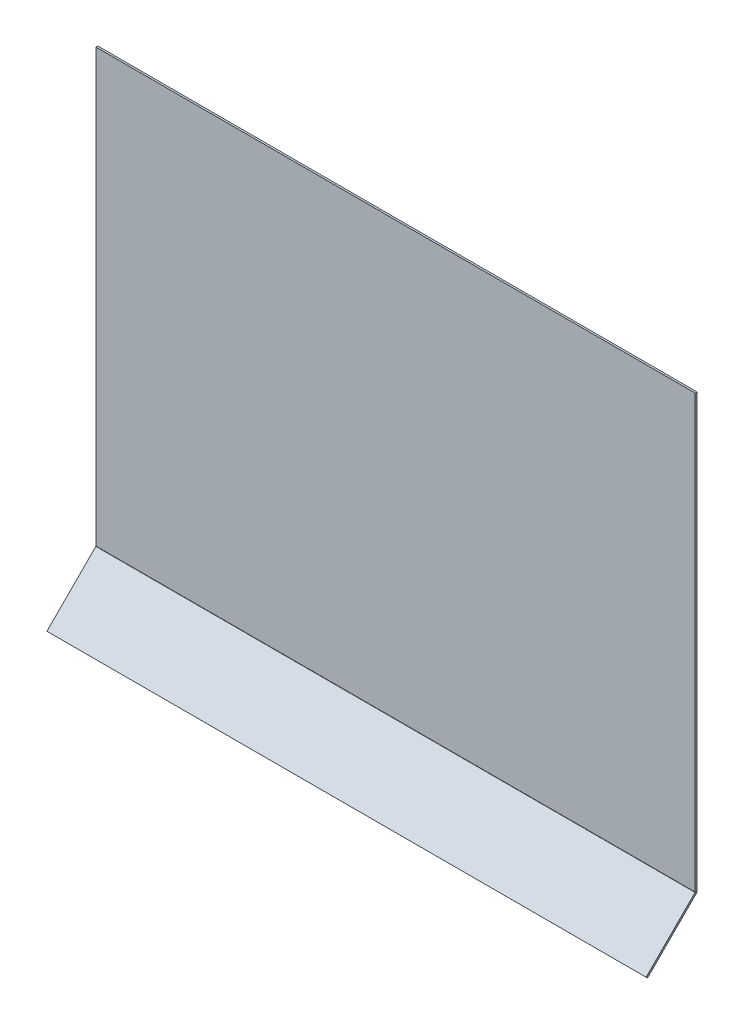
ISO-10303-21;
HEADER;
FILE_DESCRIPTION(('STEP AP214'),'2;1');
FILE_NAME('part.step','',(''),(''),'','','');
FILE_SCHEMA(('AUTOMOTIVE_DESIGN { 1 0 10303 214 1 1 1 1 }'));
ENDSEC;
DATA;
#1=APPLICATION_CONTEXT('core data for automotive mechanical design processes');
#2=APPLICATION_PROTOCOL_DEFINITION('international standard','automotive_design',2000,#1);
#3=PRODUCT_CONTEXT('',#1,'mechanical');
#4=PRODUCT('Part','Part','',(#3));
#5=PRODUCT_RELATED_PRODUCT_CATEGORY('part','',(#4));
#6=PRODUCT_DEFINITION_FORMATION('','',#4);
#7=PRODUCT_DEFINITION_CONTEXT('part definition',#1,'design');
#8=PRODUCT_DEFINITION('design','',#6,#7);
#9=PRODUCT_DEFINITION_SHAPE('','',#8);
#10=(LENGTH_UNIT() NAMED_UNIT(*) SI_UNIT(.MILLI.,.METRE.));
#11=(NAMED_UNIT(*) PLANE_ANGLE_UNIT() SI_UNIT($,.RADIAN.));
#12=(NAMED_UNIT(*) SI_UNIT($,.STERADIAN.) SOLID_ANGLE_UNIT());
#13=UNCERTAINTY_MEASURE_WITH_UNIT(LENGTH_MEASURE(1.E-05),#10,'distance_accuracy_value','');
#14=(GEOMETRIC_REPRESENTATION_CONTEXT(3) GLOBAL_UNCERTAINTY_ASSIGNED_CONTEXT((#13)) GLOBAL_UNIT_ASSIGNED_CONTEXT((#10,
#11,#12)) REPRESENTATION_CONTEXT('',''));
#15=CARTESIAN_POINT('',(0.,0.,0.));
#16=DIRECTION('',(0.,0.,1.));
#17=DIRECTION('',(1.,0.,0.));
#18=AXIS2_PLACEMENT_3D('',#15,#16,#17);
#19=CARTESIAN_POINT('',(-475.,-363.086855640565,-687.218254069481));
#20=DIRECTION('',(0.,-0.707106781186552,0.707106781186544));
#21=DIRECTION('',(1.,0.,0.));
#22=AXIS2_PLACEMENT_3D('',#19,#20,#21);
#23=PLANE('',#22);
#24=DIRECTION('',(0.,0.707106781186544,0.707106781186552));
#25=VECTOR('',#24,1.);
#26=CARTESIAN_POINT('',(-475.,-363.086855640565,-687.218254069481));
#27=LINE('',#26,#25);
#28=CARTESIAN_POINT('',(-475.,-365.208175984124,-689.339574413041));
#29=VERTEX_POINT('',#28);
#30=CARTESIAN_POINT('',(-475.,-363.086855640565,-687.218254069481));
#31=VERTEX_POINT('',#30);
#32=EDGE_CURVE('E11',#29,#31,#27,.T.);
#33=ORIENTED_EDGE('',*,*,#32,.F.);
#34=DIRECTION('',(1.,0.,0.));
#35=VECTOR('',#34,1.);
#36=CARTESIAN_POINT('',(0.,-365.208175984124,-689.339574413041));
#37=LINE('',#36,#35);
#38=CARTESIAN_POINT('',(475.,-365.208175984124,-689.339574413041));
#39=VERTEX_POINT('',#38);
#40=EDGE_CURVE('E119',#39,#29,#37,.F.);
#41=ORIENTED_EDGE('',*,*,#40,.F.);
#42=DIRECTION('',(0.,0.707106781186544,0.707106781186552));
#43=VECTOR('',#42,1.);
#44=CARTESIAN_POINT('',(475.,-363.086855640565,-687.218254069481));
#45=LINE('',#44,#43);
#46=CARTESIAN_POINT('',(475.,-363.086855640565,-687.218254069481));
#47=VERTEX_POINT('',#46);
#48=EDGE_CURVE('E51',#39,#47,#45,.T.);
#49=ORIENTED_EDGE('',*,*,#48,.T.);
#50=DIRECTION('',(1.,0.,0.));
#51=VECTOR('',#50,1.);
#52=CARTESIAN_POINT('',(-475.,-363.086855640565,-687.218254069481));
#53=LINE('',#52,#51);
#54=EDGE_CURVE('E177',#47,#31,#53,.F.);
#55=ORIENTED_EDGE('',*,*,#54,.T.);
#56=EDGE_LOOP('',(#33,#41,#49,#55));
#57=FACE_BOUND('',#56,.T.);
#58=ADVANCED_FACE('F41',(#57),#23,.T.);
#59=CARTESIAN_POINT('',(475.,-363.086855640565,-687.218254069481));
#60=DIRECTION('',(1.,0.,0.));
#61=DIRECTION('',(0.,0.707106781186552,-0.707106781186544));
#62=AXIS2_PLACEMENT_3D('',#59,#60,#61);
#63=PLANE('',#62);
#64=ORIENTED_EDGE('',*,*,#48,.F.);
#65=DIRECTION('',(0.,-0.707106781186552,0.707106781186544));
#66=VECTOR('',#65,1.);
#67=CARTESIAN_POINT('',(475.,-527.426430053602,-527.121320343564));
#68=LINE('',#67,#66);
#69=CARTESIAN_POINT('',(475.,-287.642175198581,-766.905575198582));
#70=VERTEX_POINT('',#69);
#71=EDGE_CURVE('E116',#70,#39,#68,.T.);
#72=ORIENTED_EDGE('',*,*,#71,.F.);
#73=DIRECTION('',(0.,0.707106781186547,0.707106781186547));
#74=VECTOR('',#73,1.);
#75=CARTESIAN_POINT('',(475.,-285.520854855022,-764.784254855023));
#76=LINE('',#75,#74);
#77=CARTESIAN_POINT('',(475.,-285.520854855022,-764.784254855023));
#78=VERTEX_POINT('',#77);
#79=EDGE_CURVE('E160',#70,#78,#76,.T.);
#80=ORIENTED_EDGE('',*,*,#79,.T.);
#81=DIRECTION('',(0.,0.707106781186552,-0.707106781186544));
#82=VECTOR('',#81,1.);
#83=CARTESIAN_POINT('',(475.,-363.086855640565,-687.218254069481));
#84=LINE('',#83,#82);
#85=EDGE_CURVE('E168',#78,#47,#84,.F.);
#86=ORIENTED_EDGE('',*,*,#85,.T.);
#87=EDGE_LOOP('',(#64,#72,#80,#86));
#88=FACE_BOUND('',#87,.T.);
#89=ADVANCED_FACE('F167',(#88),#63,.T.);
#90=CARTESIAN_POINT('',(475.,-285.,-764.263400000001));
#91=DIRECTION('',(-1.,0.,0.));
#92=DIRECTION('',(0.,0.,1.));
#93=AXIS2_PLACEMENT_3D('',#90,#91,#92);
#94=PLANE('',#93);
#95=ORIENTED_EDGE('',*,*,#79,.F.);
#96=CARTESIAN_POINT('',(475.,-285.,-764.263400000001));
#97=DIRECTION('',(1.,0.,0.));
#98=DIRECTION('',(0.,0.,-1.));
#99=AXIS2_PLACEMENT_3D('',#96,#97,#98);
#100=CIRCLE('',#99,3.73660000000008);
#101=CARTESIAN_POINT('',(475.,-285.,-768.));
#102=VERTEX_POINT('',#101);
#103=EDGE_CURVE('E111',#70,#102,#100,.T.);
#104=ORIENTED_EDGE('',*,*,#103,.T.);
#105=DIRECTION('',(0.,0.,1.));
#106=VECTOR('',#105,1.);
#107=CARTESIAN_POINT('',(475.,-285.,-765.));
#108=LINE('',#107,#106);
#109=CARTESIAN_POINT('',(475.,-285.,-765.));
#110=VERTEX_POINT('',#109);
#111=EDGE_CURVE('E157',#102,#110,#108,.T.);
#112=ORIENTED_EDGE('',*,*,#111,.T.);
#113=CARTESIAN_POINT('',(475.,-285.,-764.263400000001));
#114=DIRECTION('',(1.,0.,0.));
#115=DIRECTION('',(0.,0.,-1.));
#116=AXIS2_PLACEMENT_3D('',#113,#114,#115);
#117=CIRCLE('',#116,0.736600000000081);
#118=EDGE_CURVE('E100',#78,#110,#117,.T.);
#119=ORIENTED_EDGE('',*,*,#118,.F.);
#120=EDGE_LOOP('',(#95,#104,#112,#119));
#121=FACE_BOUND('',#120,.T.);
#122=ADVANCED_FACE('F182',(#121),#94,.F.);
#123=CARTESIAN_POINT('',(475.,400.,-765.));
#124=DIRECTION('',(1.,0.,0.));
#125=DIRECTION('',(0.,-1.,0.));
#126=AXIS2_PLACEMENT_3D('',#123,#124,#125);
#127=PLANE('',#126);
#128=ORIENTED_EDGE('',*,*,#111,.F.);
#129=DIRECTION('',(0.,1.,0.));
#130=VECTOR('',#129,1.);
#131=CARTESIAN_POINT('',(475.,2.11801214624424E-13,-768.));
#132=LINE('',#131,#130);
#133=CARTESIAN_POINT('',(475.,400.,-768.));
#134=VERTEX_POINT('',#133);
#135=EDGE_CURVE('E144',#134,#102,#132,.F.);
#136=ORIENTED_EDGE('',*,*,#135,.F.);
#137=DIRECTION('',(0.,0.,1.));
#138=VECTOR('',#137,1.);
#139=CARTESIAN_POINT('',(475.,400.,-765.));
#140=LINE('',#139,#138);
#141=CARTESIAN_POINT('',(475.,400.,-765.));
#142=VERTEX_POINT('',#141);
#143=EDGE_CURVE('E154',#134,#142,#140,.T.);
#144=ORIENTED_EDGE('',*,*,#143,.T.);
#145=DIRECTION('',(0.,-1.,0.));
#146=VECTOR('',#145,1.);
#147=CARTESIAN_POINT('',(475.,400.,-765.));
#148=LINE('',#147,#146);
#149=EDGE_CURVE('E212',#142,#110,#148,.T.);
#150=ORIENTED_EDGE('',*,*,#149,.T.);
#151=EDGE_LOOP('',(#128,#136,#144,#150));
#152=FACE_BOUND('',#151,.T.);
#153=ADVANCED_FACE('F209',(#152),#127,.T.);
#154=CARTESIAN_POINT('',(475.,400.,-765.));
#155=DIRECTION('',(0.,1.,0.));
#156=DIRECTION('',(1.,0.,0.));
#157=AXIS2_PLACEMENT_3D('',#154,#155,#156);
#158=PLANE('',#157);
#159=ORIENTED_EDGE('',*,*,#143,.F.);
#160=DIRECTION('',(1.,0.,0.));
#161=VECTOR('',#160,1.);
#162=CARTESIAN_POINT('',(0.,400.,-768.));
#163=LINE('',#162,#161);
#164=CARTESIAN_POINT('',(-475.,400.,-768.));
#165=VERTEX_POINT('',#164);
#166=EDGE_CURVE('E140',#165,#134,#163,.T.);
#167=ORIENTED_EDGE('',*,*,#166,.F.);
#168=DIRECTION('',(0.,0.,1.));
#169=VECTOR('',#168,1.);
#170=CARTESIAN_POINT('',(-475.,400.,-765.));
#171=LINE('',#170,#169);
#172=CARTESIAN_POINT('',(-475.,400.,-765.));
#173=VERTEX_POINT('',#172);
#174=EDGE_CURVE('E151',#165,#173,#171,.T.);
#175=ORIENTED_EDGE('',*,*,#174,.T.);
#176=DIRECTION('',(1.,0.,0.));
#177=VECTOR('',#176,1.);
#178=CARTESIAN_POINT('',(475.,400.,-765.));
#179=LINE('',#178,#177);
#180=EDGE_CURVE('E179',#173,#142,#179,.T.);
#181=ORIENTED_EDGE('',*,*,#180,.T.);
#182=EDGE_LOOP('',(#159,#167,#175,#181));
#183=FACE_BOUND('',#182,.T.);
#184=ADVANCED_FACE('F236',(#183),#158,.T.);
#185=CARTESIAN_POINT('',(-475.,400.,-765.));
#186=DIRECTION('',(-1.,0.,0.));
#187=DIRECTION('',(0.,1.,0.));
#188=AXIS2_PLACEMENT_3D('',#185,#186,#187);
#189=PLANE('',#188);
#190=ORIENTED_EDGE('',*,*,#174,.F.);
#191=DIRECTION('',(0.,1.,0.));
#192=VECTOR('',#191,1.);
#193=CARTESIAN_POINT('',(-475.,2.11801214624424E-13,-768.));
#194=LINE('',#193,#192);
#195=CARTESIAN_POINT('',(-475.,-285.,-768.));
#196=VERTEX_POINT('',#195);
#197=EDGE_CURVE('E135',#196,#165,#194,.T.);
#198=ORIENTED_EDGE('',*,*,#197,.F.);
#199=DIRECTION('',(3.01445295852664E-13,0.,1.));
#200=VECTOR('',#199,1.);
#201=CARTESIAN_POINT('',(-475.,-285.,-765.));
#202=LINE('',#201,#200);
#203=CARTESIAN_POINT('',(-475.,-285.,-765.));
#204=VERTEX_POINT('',#203);
#205=EDGE_CURVE('E99',#196,#204,#202,.T.);
#206=ORIENTED_EDGE('',*,*,#205,.T.);
#207=DIRECTION('',(0.,1.,0.));
#208=VECTOR('',#207,1.);
#209=CARTESIAN_POINT('',(-475.,400.,-765.));
#210=LINE('',#209,#208);
#211=EDGE_CURVE('E130',#204,#173,#210,.T.);
#212=ORIENTED_EDGE('',*,*,#211,.T.);
#213=EDGE_LOOP('',(#190,#198,#206,#212));
#214=FACE_BOUND('',#213,.T.);
#215=ADVANCED_FACE('F230',(#214),#189,.T.);
#216=CARTESIAN_POINT('',(-475.,-285.,-764.263400000001));
#217=DIRECTION('',(-1.,0.,0.));
#218=DIRECTION('',(0.,0.,1.));
#219=AXIS2_PLACEMENT_3D('',#216,#217,#218);
#220=PLANE('',#219);
#221=ORIENTED_EDGE('',*,*,#205,.F.);
#222=CARTESIAN_POINT('',(-475.,-285.,-764.263400000001));
#223=DIRECTION('',(1.,0.,0.));
#224=DIRECTION('',(0.,0.,-1.));
#225=AXIS2_PLACEMENT_3D('',#222,#223,#224);
#226=CIRCLE('',#225,3.73660000000008);
#227=CARTESIAN_POINT('',(-475.,-287.642175198581,-766.905575198582));
#228=VERTEX_POINT('',#227);
#229=EDGE_CURVE('E108',#196,#228,#226,.F.);
#230=ORIENTED_EDGE('',*,*,#229,.T.);
#231=DIRECTION('',(0.,0.707106781186544,0.707106781186552));
#232=VECTOR('',#231,1.);
#233=CARTESIAN_POINT('',(-475.,-285.520854855022,-764.784254855023));
#234=LINE('',#233,#232);
#235=CARTESIAN_POINT('',(-475.,-285.520854855022,-764.784254855023));
#236=VERTEX_POINT('',#235);
#237=EDGE_CURVE('E45',#228,#236,#234,.T.);
#238=ORIENTED_EDGE('',*,*,#237,.T.);
#239=CARTESIAN_POINT('',(-475.,-285.,-764.263400000001));
#240=DIRECTION('',(1.,0.,0.));
#241=DIRECTION('',(0.,0.,-1.));
#242=AXIS2_PLACEMENT_3D('',#239,#240,#241);
#243=CIRCLE('',#242,0.736600000000081);
#244=EDGE_CURVE('E189',#204,#236,#243,.F.);
#245=ORIENTED_EDGE('',*,*,#244,.F.);
#246=EDGE_LOOP('',(#221,#230,#238,#245));
#247=FACE_BOUND('',#246,.T.);
#248=ADVANCED_FACE('F122',(#247),#220,.T.);
#249=CARTESIAN_POINT('',(-475.,-285.305109710044,-765.000000000001));
#250=DIRECTION('',(-1.,0.,0.));
#251=DIRECTION('',(0.,-0.707106781186552,0.707106781186544));
#252=AXIS2_PLACEMENT_3D('',#249,#250,#251);
#253=PLANE('',#252);
#254=DIRECTION('',(0.,-0.707106781186552,0.707106781186544));
#255=VECTOR('',#254,1.);
#256=CARTESIAN_POINT('',(-475.,-527.426430053602,-527.121320343564));
#257=LINE('',#256,#255);
#258=EDGE_CURVE('E91',#29,#228,#257,.F.);
#259=ORIENTED_EDGE('',*,*,#258,.F.);
#260=ORIENTED_EDGE('',*,*,#32,.T.);
#261=DIRECTION('',(0.,-0.707106781186552,0.707106781186544));
#262=VECTOR('',#261,1.);
#263=CARTESIAN_POINT('',(-475.,-285.305109710044,-765.000000000001));
#264=LINE('',#263,#262);
#265=EDGE_CURVE('E93',#31,#236,#264,.F.);
#266=ORIENTED_EDGE('',*,*,#265,.T.);
#267=ORIENTED_EDGE('',*,*,#237,.F.);
#268=EDGE_LOOP('',(#259,#260,#266,#267));
#269=FACE_BOUND('',#268,.T.);
#270=ADVANCED_FACE('F43',(#269),#253,.T.);
#271=CARTESIAN_POINT('',(475.,-285.,-764.263400000001));
#272=DIRECTION('',(1.,0.,0.));
#273=DIRECTION('',(0.,-0.707106781186543,-0.707106781186552));
#274=AXIS2_PLACEMENT_3D('',#271,#272,#273);
#275=CYLINDRICAL_SURFACE('',#274,0.736600000000081);
#276=DIRECTION('',(-1.,0.,0.));
#277=VECTOR('',#276,1.);
#278=CARTESIAN_POINT('',(475.,-285.,-765.));
#279=LINE('',#278,#277);
#280=EDGE_CURVE('E218',#110,#204,#279,.T.);
#281=ORIENTED_EDGE('',*,*,#280,.T.);
#282=ORIENTED_EDGE('',*,*,#244,.T.);
#283=DIRECTION('',(1.,0.,0.));
#284=VECTOR('',#283,1.);
#285=CARTESIAN_POINT('',(-475.,-285.520854855022,-764.784254855022));
#286=LINE('',#285,#284);
#287=EDGE_CURVE('E176',#236,#78,#286,.T.);
#288=ORIENTED_EDGE('',*,*,#287,.T.);
#289=ORIENTED_EDGE('',*,*,#118,.T.);
#290=EDGE_LOOP('',(#281,#282,#288,#289));
#291=FACE_BOUND('',#290,.T.);
#292=ADVANCED_FACE('F191',(#291),#275,.F.);
#293=CARTESIAN_POINT('',(0.,-525.305109710043,-525.000000000005));
#294=DIRECTION('',(0.,0.707106781186544,0.707106781186552));
#295=DIRECTION('',(0.,-0.707106781186552,0.707106781186544));
#296=AXIS2_PLACEMENT_3D('',#293,#294,#295);
#297=PLANE('',#296);
#298=ORIENTED_EDGE('',*,*,#85,.F.);
#299=ORIENTED_EDGE('',*,*,#287,.F.);
#300=ORIENTED_EDGE('',*,*,#265,.F.);
#301=ORIENTED_EDGE('',*,*,#54,.F.);
#302=EDGE_LOOP('',(#298,#299,#300,#301));
#303=FACE_BOUND('',#302,.T.);
#304=ADVANCED_FACE('F174',(#303),#297,.T.);
#305=CARTESIAN_POINT('',(0.,2.10973719202344E-13,-765.));
#306=DIRECTION('',(0.,0.,-1.));
#307=DIRECTION('',(0.,1.,0.));
#308=AXIS2_PLACEMENT_3D('',#305,#306,#307);
#309=PLANE('',#308);
#310=ORIENTED_EDGE('',*,*,#211,.F.);
#311=ORIENTED_EDGE('',*,*,#280,.F.);
#312=ORIENTED_EDGE('',*,*,#149,.F.);
#313=ORIENTED_EDGE('',*,*,#180,.F.);
#314=EDGE_LOOP('',(#310,#311,#312,#313));
#315=FACE_BOUND('',#314,.T.);
#316=ADVANCED_FACE('F232',(#315),#309,.F.);
#317=CARTESIAN_POINT('',(475.,-285.,-764.263400000001));
#318=DIRECTION('',(1.,0.,0.));
#319=DIRECTION('',(0.,-0.707106781186543,-0.707106781186552));
#320=AXIS2_PLACEMENT_3D('',#317,#318,#319);
#321=CYLINDRICAL_SURFACE('',#320,3.73660000000008);
#322=DIRECTION('',(1.,0.,0.));
#323=VECTOR('',#322,1.);
#324=CARTESIAN_POINT('',(475.,-285.,-768.000000000001));
#325=LINE('',#324,#323);
#326=EDGE_CURVE('E139',#102,#196,#325,.F.);
#327=ORIENTED_EDGE('',*,*,#326,.F.);
#328=ORIENTED_EDGE('',*,*,#103,.F.);
#329=DIRECTION('',(1.,0.,0.));
#330=VECTOR('',#329,1.);
#331=CARTESIAN_POINT('',(475.,-287.642175198581,-766.905575198582));
#332=LINE('',#331,#330);
#333=EDGE_CURVE('E105',#228,#70,#332,.T.);
#334=ORIENTED_EDGE('',*,*,#333,.F.);
#335=ORIENTED_EDGE('',*,*,#229,.F.);
#336=EDGE_LOOP('',(#327,#328,#334,#335));
#337=FACE_BOUND('',#336,.T.);
#338=ADVANCED_FACE('F107',(#337),#321,.T.);
#339=CARTESIAN_POINT('',(0.,-527.426430053602,-527.121320343564));
#340=DIRECTION('',(0.,0.707106781186544,0.707106781186552));
#341=DIRECTION('',(0.,-0.707106781186552,0.707106781186544));
#342=AXIS2_PLACEMENT_3D('',#339,#340,#341);
#343=PLANE('',#342);
#344=ORIENTED_EDGE('',*,*,#71,.T.);
#345=ORIENTED_EDGE('',*,*,#40,.T.);
#346=ORIENTED_EDGE('',*,*,#258,.T.);
#347=ORIENTED_EDGE('',*,*,#333,.T.);
#348=EDGE_LOOP('',(#344,#345,#346,#347));
#349=FACE_BOUND('',#348,.T.);
#350=ADVANCED_FACE('F118',(#349),#343,.F.);
#351=CARTESIAN_POINT('',(0.,2.11801214624424E-13,-768.));
#352=DIRECTION('',(0.,0.,-1.));
#353=DIRECTION('',(0.,1.,0.));
#354=AXIS2_PLACEMENT_3D('',#351,#352,#353);
#355=PLANE('',#354);
#356=ORIENTED_EDGE('',*,*,#197,.T.);
#357=ORIENTED_EDGE('',*,*,#166,.T.);
#358=ORIENTED_EDGE('',*,*,#135,.T.);
#359=ORIENTED_EDGE('',*,*,#326,.T.);
#360=EDGE_LOOP('',(#356,#357,#358,#359));
#361=FACE_BOUND('',#360,.T.);
#362=ADVANCED_FACE('F205',(#361),#355,.T.);
#363=CLOSED_SHELL('',(#58,#89,#122,#153,#184,#215,#248,#270,#292,#304,#316,#338,#350,#362));
#364=MANIFOLD_SOLID_BREP('B2',#363);
#365=ADVANCED_BREP_SHAPE_REPRESENTATION('',(#18,#364),#14);
#366=SHAPE_DEFINITION_REPRESENTATION(#9,#365);
ENDSEC;
END-ISO-10303-21;
